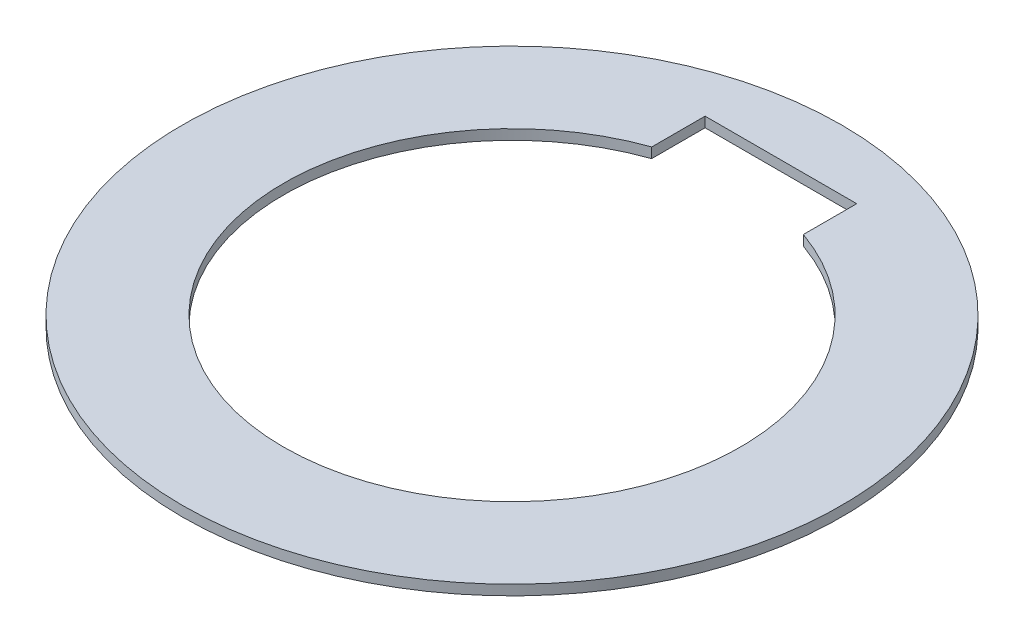
ISO-10303-21;
HEADER;
FILE_DESCRIPTION(('STEP AP214'),'2;1');
FILE_NAME('part.step','',(''),(''),'','','');
FILE_SCHEMA(('AUTOMOTIVE_DESIGN { 1 0 10303 214 1 1 1 1 }'));
ENDSEC;
DATA;
#1=APPLICATION_CONTEXT('core data for automotive mechanical design processes');
#2=APPLICATION_PROTOCOL_DEFINITION('international standard','automotive_design',2000,#1);
#3=PRODUCT_CONTEXT('',#1,'mechanical');
#4=PRODUCT('Part','Part','',(#3));
#5=PRODUCT_RELATED_PRODUCT_CATEGORY('part','',(#4));
#6=PRODUCT_DEFINITION_FORMATION('','',#4);
#7=PRODUCT_DEFINITION_CONTEXT('part definition',#1,'design');
#8=PRODUCT_DEFINITION('design','',#6,#7);
#9=PRODUCT_DEFINITION_SHAPE('','',#8);
#10=(LENGTH_UNIT() NAMED_UNIT(*) SI_UNIT(.MILLI.,.METRE.));
#11=(NAMED_UNIT(*) PLANE_ANGLE_UNIT() SI_UNIT($,.RADIAN.));
#12=(NAMED_UNIT(*) SI_UNIT($,.STERADIAN.) SOLID_ANGLE_UNIT());
#13=UNCERTAINTY_MEASURE_WITH_UNIT(LENGTH_MEASURE(1.E-05),#10,'distance_accuracy_value','');
#14=(GEOMETRIC_REPRESENTATION_CONTEXT(3) GLOBAL_UNCERTAINTY_ASSIGNED_CONTEXT((#13)) GLOBAL_UNIT_ASSIGNED_CONTEXT((#10,
#11,#12)) REPRESENTATION_CONTEXT('',''));
#15=CARTESIAN_POINT('',(0.,0.,0.));
#16=DIRECTION('',(0.,0.,1.));
#17=DIRECTION('',(1.,0.,0.));
#18=AXIS2_PLACEMENT_3D('',#15,#16,#17);
#19=CARTESIAN_POINT('',(0.,1.,0.));
#20=DIRECTION('',(0.,1.,0.));
#21=DIRECTION('',(0.,0.,1.));
#22=AXIS2_PLACEMENT_3D('',#19,#20,#21);
#23=PLANE('',#22);
#24=CARTESIAN_POINT('',(0.,1.,0.));
#25=DIRECTION('',(0.,1.,0.));
#26=DIRECTION('',(0.,0.,1.));
#27=AXIS2_PLACEMENT_3D('',#24,#25,#26);
#28=CIRCLE('',#27,32.6);
#29=CARTESIAN_POINT('',(0.,1.,32.6));
#30=VERTEX_POINT('',#29);
#31=EDGE_CURVE('E11',#30,#30,#28,.T.);
#32=ORIENTED_EDGE('',*,*,#31,.T.);
#33=EDGE_LOOP('',(#32));
#34=FACE_BOUND('',#33,.T.);
#35=DIRECTION('',(0.,0.,-1.));
#36=VECTOR('',#35,1.);
#37=CARTESIAN_POINT('',(7.5,1.,-26.6));
#38=LINE('',#37,#36);
#39=CARTESIAN_POINT('',(7.5,1.,-21.3192401365527));
#40=VERTEX_POINT('',#39);
#41=CARTESIAN_POINT('',(7.5,1.,-26.6));
#42=VERTEX_POINT('',#41);
#43=EDGE_CURVE('E83',#40,#42,#38,.T.);
#44=ORIENTED_EDGE('',*,*,#43,.F.);
#45=CARTESIAN_POINT('',(0.,1.,0.));
#46=DIRECTION('',(0.,1.,0.));
#47=DIRECTION('',(0.,0.,1.));
#48=AXIS2_PLACEMENT_3D('',#45,#46,#47);
#49=CIRCLE('',#48,22.6);
#50=CARTESIAN_POINT('',(-7.5,1.,-21.3192401365527));
#51=VERTEX_POINT('',#50);
#52=EDGE_CURVE('E75',#51,#40,#49,.T.);
#53=ORIENTED_EDGE('',*,*,#52,.F.);
#54=DIRECTION('',(0.,0.,1.));
#55=VECTOR('',#54,1.);
#56=CARTESIAN_POINT('',(-7.5,1.,-26.6));
#57=LINE('',#56,#55);
#58=CARTESIAN_POINT('',(-7.5,1.,-26.6));
#59=VERTEX_POINT('',#58);
#60=EDGE_CURVE('E96',#59,#51,#57,.T.);
#61=ORIENTED_EDGE('',*,*,#60,.F.);
#62=DIRECTION('',(-1.,0.,0.));
#63=VECTOR('',#62,1.);
#64=CARTESIAN_POINT('',(-7.5,1.,-26.6));
#65=LINE('',#64,#63);
#66=EDGE_CURVE('E94',#42,#59,#65,.T.);
#67=ORIENTED_EDGE('',*,*,#66,.F.);
#68=EDGE_LOOP('',(#44,#53,#61,#67));
#69=FACE_BOUND('',#68,.T.);
#70=ADVANCED_FACE('F34',(#34,#69),#23,.T.);
#71=CARTESIAN_POINT('',(0.,0.,0.));
#72=DIRECTION('',(0.,1.,0.));
#73=DIRECTION('',(0.,0.,1.));
#74=AXIS2_PLACEMENT_3D('',#71,#72,#73);
#75=PLANE('',#74);
#76=CARTESIAN_POINT('',(0.,0.,0.));
#77=DIRECTION('',(0.,1.,0.));
#78=DIRECTION('',(0.,0.,1.));
#79=AXIS2_PLACEMENT_3D('',#76,#77,#78);
#80=CIRCLE('',#79,32.6);
#81=CARTESIAN_POINT('',(0.,0.,32.6));
#82=VERTEX_POINT('',#81);
#83=EDGE_CURVE('E38',#82,#82,#80,.T.);
#84=ORIENTED_EDGE('',*,*,#83,.F.);
#85=EDGE_LOOP('',(#84));
#86=FACE_BOUND('',#85,.T.);
#87=CARTESIAN_POINT('',(0.,0.,0.));
#88=DIRECTION('',(0.,1.,0.));
#89=DIRECTION('',(0.,0.,1.));
#90=AXIS2_PLACEMENT_3D('',#87,#88,#89);
#91=CIRCLE('',#90,22.6);
#92=CARTESIAN_POINT('',(-7.5,0.,-21.3192401365527));
#93=VERTEX_POINT('',#92);
#94=CARTESIAN_POINT('',(7.5,0.,-21.3192401365527));
#95=VERTEX_POINT('',#94);
#96=EDGE_CURVE('E57',#93,#95,#91,.T.);
#97=ORIENTED_EDGE('',*,*,#96,.T.);
#98=DIRECTION('',(0.,0.,-1.));
#99=VECTOR('',#98,1.);
#100=CARTESIAN_POINT('',(7.5,0.,-26.6));
#101=LINE('',#100,#99);
#102=CARTESIAN_POINT('',(7.5,0.,-26.6));
#103=VERTEX_POINT('',#102);
#104=EDGE_CURVE('E90',#95,#103,#101,.T.);
#105=ORIENTED_EDGE('',*,*,#104,.T.);
#106=DIRECTION('',(-1.,0.,0.));
#107=VECTOR('',#106,1.);
#108=CARTESIAN_POINT('',(-7.5,0.,-26.6));
#109=LINE('',#108,#107);
#110=CARTESIAN_POINT('',(-7.5,0.,-26.6));
#111=VERTEX_POINT('',#110);
#112=EDGE_CURVE('E102',#103,#111,#109,.T.);
#113=ORIENTED_EDGE('',*,*,#112,.T.);
#114=DIRECTION('',(0.,0.,1.));
#115=VECTOR('',#114,1.);
#116=CARTESIAN_POINT('',(-7.5,0.,-26.6));
#117=LINE('',#116,#115);
#118=EDGE_CURVE('E84',#111,#93,#117,.T.);
#119=ORIENTED_EDGE('',*,*,#118,.T.);
#120=EDGE_LOOP('',(#97,#105,#113,#119));
#121=FACE_BOUND('',#120,.T.);
#122=ADVANCED_FACE('F113',(#86,#121),#75,.F.);
#123=CARTESIAN_POINT('',(0.,1.,0.));
#124=DIRECTION('',(0.,-1.,0.));
#125=DIRECTION('',(0.,0.,-1.));
#126=AXIS2_PLACEMENT_3D('',#123,#124,#125);
#127=CYLINDRICAL_SURFACE('',#126,32.6);
#128=ORIENTED_EDGE('',*,*,#31,.F.);
#129=EDGE_LOOP('',(#128));
#130=FACE_BOUND('',#129,.T.);
#131=ORIENTED_EDGE('',*,*,#83,.T.);
#132=EDGE_LOOP('',(#131));
#133=FACE_BOUND('',#132,.T.);
#134=ADVANCED_FACE('F36',(#130,#133),#127,.T.);
#135=CARTESIAN_POINT('',(0.,1.,0.));
#136=DIRECTION('',(0.,-1.,0.));
#137=DIRECTION('',(0.,0.,-1.));
#138=AXIS2_PLACEMENT_3D('',#135,#136,#137);
#139=CYLINDRICAL_SURFACE('',#138,22.6);
#140=ORIENTED_EDGE('',*,*,#96,.F.);
#141=DIRECTION('',(0.,-1.,0.));
#142=VECTOR('',#141,1.);
#143=CARTESIAN_POINT('',(-7.5,1.,-21.3192401365527));
#144=LINE('',#143,#142);
#145=EDGE_CURVE('E79',#51,#93,#144,.T.);
#146=ORIENTED_EDGE('',*,*,#145,.F.);
#147=ORIENTED_EDGE('',*,*,#52,.T.);
#148=DIRECTION('',(0.,-1.,0.));
#149=VECTOR('',#148,1.);
#150=CARTESIAN_POINT('',(7.5,1.,-21.3192401365527));
#151=LINE('',#150,#149);
#152=EDGE_CURVE('E78',#40,#95,#151,.T.);
#153=ORIENTED_EDGE('',*,*,#152,.T.);
#154=EDGE_LOOP('',(#140,#146,#147,#153));
#155=FACE_BOUND('',#154,.T.);
#156=ADVANCED_FACE('F77',(#155),#139,.F.);
#157=CARTESIAN_POINT('',(7.5,1.,-26.6));
#158=DIRECTION('',(-1.,0.,0.));
#159=DIRECTION('',(0.,0.,1.));
#160=AXIS2_PLACEMENT_3D('',#157,#158,#159);
#161=PLANE('',#160);
#162=ORIENTED_EDGE('',*,*,#104,.F.);
#163=ORIENTED_EDGE('',*,*,#152,.F.);
#164=ORIENTED_EDGE('',*,*,#43,.T.);
#165=DIRECTION('',(0.,-1.,0.));
#166=VECTOR('',#165,1.);
#167=CARTESIAN_POINT('',(7.5,1.,-26.6));
#168=LINE('',#167,#166);
#169=EDGE_CURVE('E91',#42,#103,#168,.T.);
#170=ORIENTED_EDGE('',*,*,#169,.T.);
#171=EDGE_LOOP('',(#162,#163,#164,#170));
#172=FACE_BOUND('',#171,.T.);
#173=ADVANCED_FACE('F87',(#172),#161,.T.);
#174=CARTESIAN_POINT('',(-7.5,1.,-26.6));
#175=DIRECTION('',(0.,0.,1.));
#176=DIRECTION('',(1.,0.,0.));
#177=AXIS2_PLACEMENT_3D('',#174,#175,#176);
#178=PLANE('',#177);
#179=ORIENTED_EDGE('',*,*,#112,.F.);
#180=ORIENTED_EDGE('',*,*,#169,.F.);
#181=ORIENTED_EDGE('',*,*,#66,.T.);
#182=DIRECTION('',(0.,-1.,0.));
#183=VECTOR('',#182,1.);
#184=CARTESIAN_POINT('',(-7.5,1.,-26.6));
#185=LINE('',#184,#183);
#186=EDGE_CURVE('E49',#59,#111,#185,.T.);
#187=ORIENTED_EDGE('',*,*,#186,.T.);
#188=EDGE_LOOP('',(#179,#180,#181,#187));
#189=FACE_BOUND('',#188,.T.);
#190=ADVANCED_FACE('F111',(#189),#178,.T.);
#191=CARTESIAN_POINT('',(-7.5,1.,-26.6));
#192=DIRECTION('',(1.,0.,0.));
#193=DIRECTION('',(0.,0.,-1.));
#194=AXIS2_PLACEMENT_3D('',#191,#192,#193);
#195=PLANE('',#194);
#196=ORIENTED_EDGE('',*,*,#118,.F.);
#197=ORIENTED_EDGE('',*,*,#186,.F.);
#198=ORIENTED_EDGE('',*,*,#60,.T.);
#199=ORIENTED_EDGE('',*,*,#145,.T.);
#200=EDGE_LOOP('',(#196,#197,#198,#199));
#201=FACE_BOUND('',#200,.T.);
#202=ADVANCED_FACE('F114',(#201),#195,.T.);
#203=CLOSED_SHELL('',(#70,#122,#134,#156,#173,#190,#202));
#204=MANIFOLD_SOLID_BREP('B2',#203);
#205=ADVANCED_BREP_SHAPE_REPRESENTATION('',(#18,#204),#14);
#206=SHAPE_DEFINITION_REPRESENTATION(#9,#205);
ENDSEC;
END-ISO-10303-21;
